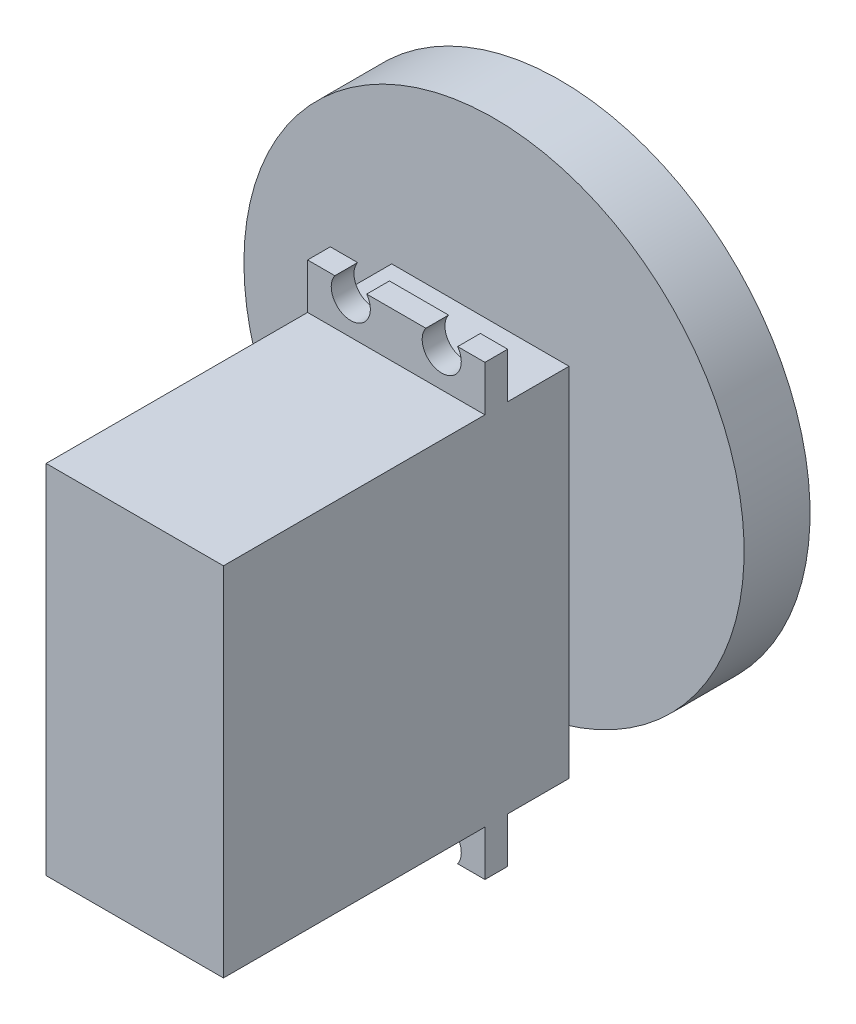
ISO-10303-21;
HEADER;
FILE_DESCRIPTION(('STEP AP214'),'2;1');
FILE_NAME('part.step','',(''),(''),'','','');
FILE_SCHEMA(('AUTOMOTIVE_DESIGN { 1 0 10303 214 1 1 1 1 }'));
ENDSEC;
DATA;
#1=APPLICATION_CONTEXT('core data for automotive mechanical design processes');
#2=APPLICATION_PROTOCOL_DEFINITION('international standard','automotive_design',2000,#1);
#3=PRODUCT_CONTEXT('',#1,'mechanical');
#4=PRODUCT('Part','Part','',(#3));
#5=PRODUCT_RELATED_PRODUCT_CATEGORY('part','',(#4));
#6=PRODUCT_DEFINITION_FORMATION('','',#4);
#7=PRODUCT_DEFINITION_CONTEXT('part definition',#1,'design');
#8=PRODUCT_DEFINITION('design','',#6,#7);
#9=PRODUCT_DEFINITION_SHAPE('','',#8);
#10=(LENGTH_UNIT() NAMED_UNIT(*) SI_UNIT(.MILLI.,.METRE.));
#11=(NAMED_UNIT(*) PLANE_ANGLE_UNIT() SI_UNIT($,.RADIAN.));
#12=(NAMED_UNIT(*) SI_UNIT($,.STERADIAN.) SOLID_ANGLE_UNIT());
#13=UNCERTAINTY_MEASURE_WITH_UNIT(LENGTH_MEASURE(1.E-05),#10,'distance_accuracy_value','');
#14=(GEOMETRIC_REPRESENTATION_CONTEXT(3) GLOBAL_UNCERTAINTY_ASSIGNED_CONTEXT((#13)) GLOBAL_UNIT_ASSIGNED_CONTEXT((#10,
#11,#12)) REPRESENTATION_CONTEXT('',''));
#15=CARTESIAN_POINT('',(0.,0.,0.));
#16=DIRECTION('',(0.,0.,1.));
#17=DIRECTION('',(1.,0.,0.));
#18=AXIS2_PLACEMENT_3D('',#15,#16,#17);
#19=CARTESIAN_POINT('',(4.826,43.688,-2.54));
#20=DIRECTION('',(0.,0.,-1.));
#21=DIRECTION('',(-1.,0.,0.));
#22=AXIS2_PLACEMENT_3D('',#19,#20,#21);
#23=PLANE('',#22);
#24=DIRECTION('',(1.,0.,0.));
#25=VECTOR('',#24,1.);
#26=CARTESIAN_POINT('',(0.,39.878,-2.54));
#27=LINE('',#26,#25);
#28=CARTESIAN_POINT('',(0.,39.878,-2.54));
#29=VERTEX_POINT('',#28);
#30=CARTESIAN_POINT('',(19.812,39.878,-2.54));
#31=VERTEX_POINT('',#30);
#32=EDGE_CURVE('E194',#29,#31,#27,.T.);
#33=ORIENTED_EDGE('',*,*,#32,.F.);
#34=DIRECTION('',(0.,1.,0.));
#35=VECTOR('',#34,1.);
#36=CARTESIAN_POINT('',(0.,-5.08,-2.54));
#37=LINE('',#36,#35);
#38=CARTESIAN_POINT('',(0.,44.958,-2.54));
#39=VERTEX_POINT('',#38);
#40=EDGE_CURVE('E400',#29,#39,#37,.T.);
#41=ORIENTED_EDGE('',*,*,#40,.T.);
#42=DIRECTION('',(1.,0.,0.));
#43=VECTOR('',#42,1.);
#44=CARTESIAN_POINT('',(0.,44.958,-2.54));
#45=LINE('',#44,#43);
#46=CARTESIAN_POINT('',(3.04872586245116,44.958,-2.54));
#47=VERTEX_POINT('',#46);
#48=EDGE_CURVE('E488',#39,#47,#45,.T.);
#49=ORIENTED_EDGE('',*,*,#48,.T.);
#50=CARTESIAN_POINT('',(4.826,43.688,-2.54));
#51=DIRECTION('',(0.,0.,1.));
#52=DIRECTION('',(-1.,0.,0.));
#53=AXIS2_PLACEMENT_3D('',#50,#51,#52);
#54=CIRCLE('',#53,2.1844);
#55=CARTESIAN_POINT('',(6.60327413754884,44.958,-2.54));
#56=VERTEX_POINT('',#55);
#57=EDGE_CURVE('E502',#47,#56,#54,.T.);
#58=ORIENTED_EDGE('',*,*,#57,.T.);
#59=DIRECTION('',(1.,0.,0.));
#60=VECTOR('',#59,1.);
#61=CARTESIAN_POINT('',(6.60327413754884,44.958,-2.54));
#62=LINE('',#61,#60);
#63=CARTESIAN_POINT('',(13.2087258624512,44.958,-2.54));
#64=VERTEX_POINT('',#63);
#65=EDGE_CURVE('E500',#56,#64,#62,.T.);
#66=ORIENTED_EDGE('',*,*,#65,.T.);
#67=CARTESIAN_POINT('',(14.986,43.688,-2.54));
#68=DIRECTION('',(0.,0.,1.));
#69=DIRECTION('',(-1.,0.,0.));
#70=AXIS2_PLACEMENT_3D('',#67,#68,#69);
#71=CIRCLE('',#70,2.1844);
#72=CARTESIAN_POINT('',(16.7632741375488,44.958,-2.54));
#73=VERTEX_POINT('',#72);
#74=EDGE_CURVE('E498',#64,#73,#71,.T.);
#75=ORIENTED_EDGE('',*,*,#74,.T.);
#76=DIRECTION('',(1.,0.,0.));
#77=VECTOR('',#76,1.);
#78=CARTESIAN_POINT('',(16.7632741375488,44.958,-2.54));
#79=LINE('',#78,#77);
#80=CARTESIAN_POINT('',(19.812,44.958,-2.54));
#81=VERTEX_POINT('',#80);
#82=EDGE_CURVE('E481',#73,#81,#79,.T.);
#83=ORIENTED_EDGE('',*,*,#82,.T.);
#84=DIRECTION('',(0.,-1.,0.));
#85=VECTOR('',#84,1.);
#86=CARTESIAN_POINT('',(19.812,-5.08,-2.54));
#87=LINE('',#86,#85);
#88=EDGE_CURVE('E58',#81,#31,#87,.T.);
#89=ORIENTED_EDGE('',*,*,#88,.T.);
#90=EDGE_LOOP('',(#33,#41,#49,#58,#66,#75,#83,#89));
#91=FACE_BOUND('',#90,.T.);
#92=ADVANCED_FACE('F35',(#91),#23,.T.);
#93=CARTESIAN_POINT('',(0.,0.,29.21));
#94=DIRECTION('',(1.,0.,0.));
#95=DIRECTION('',(0.,1.,0.));
#96=AXIS2_PLACEMENT_3D('',#93,#94,#95);
#97=PLANE('',#96);
#98=DIRECTION('',(0.,0.,-1.));
#99=VECTOR('',#98,1.);
#100=CARTESIAN_POINT('',(0.,39.878,29.21));
#101=LINE('',#100,#99);
#102=CARTESIAN_POINT('',(0.,39.878,29.21));
#103=VERTEX_POINT('',#102);
#104=CARTESIAN_POINT('',(0.,39.878,0.));
#105=VERTEX_POINT('',#104);
#106=EDGE_CURVE('E358',#103,#105,#101,.T.);
#107=ORIENTED_EDGE('',*,*,#106,.T.);
#108=DIRECTION('',(0.,1.,0.));
#109=VECTOR('',#108,1.);
#110=CARTESIAN_POINT('',(0.,-5.08,0.));
#111=LINE('',#110,#109);
#112=CARTESIAN_POINT('',(0.,44.958,0.));
#113=VERTEX_POINT('',#112);
#114=EDGE_CURVE('E195',#105,#113,#111,.T.);
#115=ORIENTED_EDGE('',*,*,#114,.T.);
#116=DIRECTION('',(0.,0.,1.));
#117=VECTOR('',#116,1.);
#118=CARTESIAN_POINT('',(0.,44.958,-2.54));
#119=LINE('',#118,#117);
#120=EDGE_CURVE('E347',#39,#113,#119,.T.);
#121=ORIENTED_EDGE('',*,*,#120,.F.);
#122=ORIENTED_EDGE('',*,*,#40,.F.);
#123=DIRECTION('',(0.,0.,1.));
#124=VECTOR('',#123,1.);
#125=CARTESIAN_POINT('',(0.,39.878,-9.398));
#126=LINE('',#125,#124);
#127=CARTESIAN_POINT('',(0.,39.878,-9.398));
#128=VERTEX_POINT('',#127);
#129=EDGE_CURVE('E209',#128,#29,#126,.T.);
#130=ORIENTED_EDGE('',*,*,#129,.F.);
#131=DIRECTION('',(0.,1.,0.));
#132=VECTOR('',#131,1.);
#133=CARTESIAN_POINT('',(0.,0.,-9.398));
#134=LINE('',#133,#132);
#135=CARTESIAN_POINT('',(0.,0.,-9.398));
#136=VERTEX_POINT('',#135);
#137=EDGE_CURVE('E188',#136,#128,#134,.T.);
#138=ORIENTED_EDGE('',*,*,#137,.F.);
#139=DIRECTION('',(0.,0.,1.));
#140=VECTOR('',#139,1.);
#141=CARTESIAN_POINT('',(0.,0.,-9.398));
#142=LINE('',#141,#140);
#143=CARTESIAN_POINT('',(0.,0.,-2.54));
#144=VERTEX_POINT('',#143);
#145=EDGE_CURVE('E199',#136,#144,#142,.T.);
#146=ORIENTED_EDGE('',*,*,#145,.T.);
#147=CARTESIAN_POINT('',(0.,-5.08,-2.54));
#148=VERTEX_POINT('',#147);
#149=EDGE_CURVE('E486',#148,#144,#37,.T.);
#150=ORIENTED_EDGE('',*,*,#149,.F.);
#151=DIRECTION('',(0.,0.,1.));
#152=VECTOR('',#151,1.);
#153=CARTESIAN_POINT('',(0.,-5.08,-2.54));
#154=LINE('',#153,#152);
#155=CARTESIAN_POINT('',(0.,-5.08,0.));
#156=VERTEX_POINT('',#155);
#157=EDGE_CURVE('E401',#148,#156,#154,.T.);
#158=ORIENTED_EDGE('',*,*,#157,.T.);
#159=CARTESIAN_POINT('',(0.,0.,0.));
#160=VERTEX_POINT('',#159);
#161=EDGE_CURVE('E197',#156,#160,#111,.T.);
#162=ORIENTED_EDGE('',*,*,#161,.T.);
#163=DIRECTION('',(0.,0.,-1.));
#164=VECTOR('',#163,1.);
#165=CARTESIAN_POINT('',(0.,0.,29.21));
#166=LINE('',#165,#164);
#167=CARTESIAN_POINT('',(0.,0.,29.21));
#168=VERTEX_POINT('',#167);
#169=EDGE_CURVE('E43',#168,#160,#166,.T.);
#170=ORIENTED_EDGE('',*,*,#169,.F.);
#171=DIRECTION('',(0.,-1.,0.));
#172=VECTOR('',#171,1.);
#173=CARTESIAN_POINT('',(0.,0.,29.21));
#174=LINE('',#173,#172);
#175=EDGE_CURVE('E369',#103,#168,#174,.T.);
#176=ORIENTED_EDGE('',*,*,#175,.F.);
#177=EDGE_LOOP('',(#107,#115,#121,#122,#130,#138,#146,#150,#158,#162,#170,#176));
#178=FACE_BOUND('',#177,.T.);
#179=ADVANCED_FACE('F37',(#178),#97,.F.);
#180=CARTESIAN_POINT('',(0.,0.,29.21));
#181=DIRECTION('',(0.,1.,0.));
#182=DIRECTION('',(0.,0.,1.));
#183=AXIS2_PLACEMENT_3D('',#180,#181,#182);
#184=PLANE('',#183);
#185=DIRECTION('',(1.,0.,0.));
#186=VECTOR('',#185,1.);
#187=CARTESIAN_POINT('',(0.,0.,0.));
#188=LINE('',#187,#186);
#189=CARTESIAN_POINT('',(19.812,0.,0.));
#190=VERTEX_POINT('',#189);
#191=EDGE_CURVE('E340',#160,#190,#188,.T.);
#192=ORIENTED_EDGE('',*,*,#191,.T.);
#193=DIRECTION('',(0.,0.,-1.));
#194=VECTOR('',#193,1.);
#195=CARTESIAN_POINT('',(19.812,0.,29.21));
#196=LINE('',#195,#194);
#197=CARTESIAN_POINT('',(19.812,0.,29.21));
#198=VERTEX_POINT('',#197);
#199=EDGE_CURVE('E341',#198,#190,#196,.T.);
#200=ORIENTED_EDGE('',*,*,#199,.F.);
#201=DIRECTION('',(1.,0.,0.));
#202=VECTOR('',#201,1.);
#203=CARTESIAN_POINT('',(0.,0.,29.21));
#204=LINE('',#203,#202);
#205=EDGE_CURVE('E377',#168,#198,#204,.T.);
#206=ORIENTED_EDGE('',*,*,#205,.F.);
#207=ORIENTED_EDGE('',*,*,#169,.T.);
#208=EDGE_LOOP('',(#192,#200,#206,#207));
#209=FACE_BOUND('',#208,.T.);
#210=ADVANCED_FACE('F271',(#209),#184,.F.);
#211=CARTESIAN_POINT('',(19.812,0.,29.21));
#212=DIRECTION('',(-1.,0.,0.));
#213=DIRECTION('',(0.,-1.,0.));
#214=AXIS2_PLACEMENT_3D('',#211,#212,#213);
#215=PLANE('',#214);
#216=ORIENTED_EDGE('',*,*,#199,.T.);
#217=DIRECTION('',(0.,-1.,0.));
#218=VECTOR('',#217,1.);
#219=CARTESIAN_POINT('',(19.812,-5.08,0.));
#220=LINE('',#219,#218);
#221=CARTESIAN_POINT('',(19.812,-5.08,0.));
#222=VERTEX_POINT('',#221);
#223=EDGE_CURVE('E350',#190,#222,#220,.T.);
#224=ORIENTED_EDGE('',*,*,#223,.T.);
#225=DIRECTION('',(0.,0.,1.));
#226=VECTOR('',#225,1.);
#227=CARTESIAN_POINT('',(19.812,-5.08,-2.54));
#228=LINE('',#227,#226);
#229=CARTESIAN_POINT('',(19.812,-5.08,-2.54));
#230=VERTEX_POINT('',#229);
#231=EDGE_CURVE('E417',#230,#222,#228,.T.);
#232=ORIENTED_EDGE('',*,*,#231,.F.);
#233=CARTESIAN_POINT('',(19.812,0.,-2.54));
#234=VERTEX_POINT('',#233);
#235=EDGE_CURVE('E221',#234,#230,#87,.T.);
#236=ORIENTED_EDGE('',*,*,#235,.F.);
#237=DIRECTION('',(0.,0.,1.));
#238=VECTOR('',#237,1.);
#239=CARTESIAN_POINT('',(19.812,0.,-9.398));
#240=LINE('',#239,#238);
#241=CARTESIAN_POINT('',(19.812,0.,-9.398));
#242=VERTEX_POINT('',#241);
#243=EDGE_CURVE('E179',#242,#234,#240,.T.);
#244=ORIENTED_EDGE('',*,*,#243,.F.);
#245=DIRECTION('',(0.,-1.,0.));
#246=VECTOR('',#245,1.);
#247=CARTESIAN_POINT('',(19.812,39.878,-9.398));
#248=LINE('',#247,#246);
#249=CARTESIAN_POINT('',(19.812,39.878,-9.398));
#250=VERTEX_POINT('',#249);
#251=EDGE_CURVE('E171',#250,#242,#248,.T.);
#252=ORIENTED_EDGE('',*,*,#251,.F.);
#253=DIRECTION('',(0.,0.,1.));
#254=VECTOR('',#253,1.);
#255=CARTESIAN_POINT('',(19.812,39.878,-9.398));
#256=LINE('',#255,#254);
#257=EDGE_CURVE('E176',#250,#31,#256,.T.);
#258=ORIENTED_EDGE('',*,*,#257,.T.);
#259=ORIENTED_EDGE('',*,*,#88,.F.);
#260=DIRECTION('',(0.,0.,1.));
#261=VECTOR('',#260,1.);
#262=CARTESIAN_POINT('',(19.812,44.958,-2.54));
#263=LINE('',#262,#261);
#264=CARTESIAN_POINT('',(19.812,44.958,0.));
#265=VERTEX_POINT('',#264);
#266=EDGE_CURVE('E419',#81,#265,#263,.T.);
#267=ORIENTED_EDGE('',*,*,#266,.T.);
#268=CARTESIAN_POINT('',(19.812,39.878,0.));
#269=VERTEX_POINT('',#268);
#270=EDGE_CURVE('E383',#265,#269,#220,.T.);
#271=ORIENTED_EDGE('',*,*,#270,.T.);
#272=DIRECTION('',(0.,0.,-1.));
#273=VECTOR('',#272,1.);
#274=CARTESIAN_POINT('',(19.812,39.878,29.21));
#275=LINE('',#274,#273);
#276=CARTESIAN_POINT('',(19.812,39.878,29.21));
#277=VERTEX_POINT('',#276);
#278=EDGE_CURVE('E354',#277,#269,#275,.T.);
#279=ORIENTED_EDGE('',*,*,#278,.F.);
#280=DIRECTION('',(0.,1.,0.));
#281=VECTOR('',#280,1.);
#282=CARTESIAN_POINT('',(19.812,0.,29.21));
#283=LINE('',#282,#281);
#284=EDGE_CURVE('E353',#198,#277,#283,.T.);
#285=ORIENTED_EDGE('',*,*,#284,.F.);
#286=EDGE_LOOP('',(#216,#224,#232,#236,#244,#252,#258,#259,#267,#271,#279,#285));
#287=FACE_BOUND('',#286,.T.);
#288=ADVANCED_FACE('F174',(#287),#215,.F.);
#289=CARTESIAN_POINT('',(0.,39.878,29.21));
#290=DIRECTION('',(0.,-1.,0.));
#291=DIRECTION('',(0.,0.,-1.));
#292=AXIS2_PLACEMENT_3D('',#289,#290,#291);
#293=PLANE('',#292);
#294=DIRECTION('',(-1.,0.,0.));
#295=VECTOR('',#294,1.);
#296=CARTESIAN_POINT('',(0.,39.878,0.));
#297=LINE('',#296,#295);
#298=EDGE_CURVE('E346',#269,#105,#297,.T.);
#299=ORIENTED_EDGE('',*,*,#298,.T.);
#300=ORIENTED_EDGE('',*,*,#106,.F.);
#301=DIRECTION('',(-1.,0.,0.));
#302=VECTOR('',#301,1.);
#303=CARTESIAN_POINT('',(0.,39.878,29.21));
#304=LINE('',#303,#302);
#305=EDGE_CURVE('E374',#277,#103,#304,.T.);
#306=ORIENTED_EDGE('',*,*,#305,.F.);
#307=ORIENTED_EDGE('',*,*,#278,.T.);
#308=EDGE_LOOP('',(#299,#300,#306,#307));
#309=FACE_BOUND('',#308,.T.);
#310=ADVANCED_FACE('F327',(#309),#293,.F.);
#311=CARTESIAN_POINT('',(0.,0.,29.21));
#312=DIRECTION('',(0.,0.,-1.));
#313=DIRECTION('',(-1.,0.,0.));
#314=AXIS2_PLACEMENT_3D('',#311,#312,#313);
#315=PLANE('',#314);
#316=ORIENTED_EDGE('',*,*,#175,.T.);
#317=ORIENTED_EDGE('',*,*,#205,.T.);
#318=ORIENTED_EDGE('',*,*,#284,.T.);
#319=ORIENTED_EDGE('',*,*,#305,.T.);
#320=EDGE_LOOP('',(#316,#317,#318,#319));
#321=FACE_BOUND('',#320,.T.);
#322=ADVANCED_FACE('F324',(#321),#315,.F.);
#323=CARTESIAN_POINT('',(4.826,43.688,0.));
#324=DIRECTION('',(0.,0.,-1.));
#325=DIRECTION('',(-1.,0.,0.));
#326=AXIS2_PLACEMENT_3D('',#323,#324,#325);
#327=PLANE('',#326);
#328=ORIENTED_EDGE('',*,*,#298,.F.);
#329=ORIENTED_EDGE('',*,*,#270,.F.);
#330=DIRECTION('',(1.,0.,0.));
#331=VECTOR('',#330,1.);
#332=CARTESIAN_POINT('',(16.7632741375488,44.958,0.));
#333=LINE('',#332,#331);
#334=CARTESIAN_POINT('',(16.7632741375488,44.958,0.));
#335=VERTEX_POINT('',#334);
#336=EDGE_CURVE('E384',#335,#265,#333,.T.);
#337=ORIENTED_EDGE('',*,*,#336,.F.);
#338=CARTESIAN_POINT('',(14.986,43.688,0.));
#339=DIRECTION('',(0.,0.,1.));
#340=DIRECTION('',(-1.,0.,0.));
#341=AXIS2_PLACEMENT_3D('',#338,#339,#340);
#342=CIRCLE('',#341,2.1844);
#343=CARTESIAN_POINT('',(13.2087258624512,44.958,0.));
#344=VERTEX_POINT('',#343);
#345=EDGE_CURVE('E447',#344,#335,#342,.T.);
#346=ORIENTED_EDGE('',*,*,#345,.F.);
#347=DIRECTION('',(1.,0.,0.));
#348=VECTOR('',#347,1.);
#349=CARTESIAN_POINT('',(6.60327413754884,44.958,0.));
#350=LINE('',#349,#348);
#351=CARTESIAN_POINT('',(6.60327413754884,44.958,0.));
#352=VERTEX_POINT('',#351);
#353=EDGE_CURVE('E446',#352,#344,#350,.T.);
#354=ORIENTED_EDGE('',*,*,#353,.F.);
#355=CARTESIAN_POINT('',(4.826,43.688,0.));
#356=DIRECTION('',(0.,0.,1.));
#357=DIRECTION('',(-1.,0.,0.));
#358=AXIS2_PLACEMENT_3D('',#355,#356,#357);
#359=CIRCLE('',#358,2.1844);
#360=CARTESIAN_POINT('',(3.04872586245116,44.958,0.));
#361=VERTEX_POINT('',#360);
#362=EDGE_CURVE('E444',#361,#352,#359,.T.);
#363=ORIENTED_EDGE('',*,*,#362,.F.);
#364=DIRECTION('',(1.,0.,0.));
#365=VECTOR('',#364,1.);
#366=CARTESIAN_POINT('',(0.,44.958,0.));
#367=LINE('',#366,#365);
#368=EDGE_CURVE('E437',#113,#361,#367,.T.);
#369=ORIENTED_EDGE('',*,*,#368,.F.);
#370=ORIENTED_EDGE('',*,*,#114,.F.);
#371=EDGE_LOOP('',(#328,#329,#337,#346,#354,#363,#369,#370));
#372=FACE_BOUND('',#371,.T.);
#373=ADVANCED_FACE('F282',(#372),#327,.F.);
#374=CARTESIAN_POINT('',(0.,44.958,-2.54));
#375=DIRECTION('',(0.,-1.,0.));
#376=DIRECTION('',(0.,0.,-1.));
#377=AXIS2_PLACEMENT_3D('',#374,#375,#376);
#378=PLANE('',#377);
#379=ORIENTED_EDGE('',*,*,#368,.T.);
#380=DIRECTION('',(0.,0.,1.));
#381=VECTOR('',#380,1.);
#382=CARTESIAN_POINT('',(3.04872586245116,44.958,-2.54));
#383=LINE('',#382,#381);
#384=EDGE_CURVE('E431',#47,#361,#383,.T.);
#385=ORIENTED_EDGE('',*,*,#384,.F.);
#386=ORIENTED_EDGE('',*,*,#48,.F.);
#387=ORIENTED_EDGE('',*,*,#120,.T.);
#388=EDGE_LOOP('',(#379,#385,#386,#387));
#389=FACE_BOUND('',#388,.T.);
#390=ADVANCED_FACE('F319',(#389),#378,.F.);
#391=CARTESIAN_POINT('',(4.826,43.688,-2.54));
#392=DIRECTION('',(0.,0.,1.));
#393=DIRECTION('',(1.,0.,0.));
#394=AXIS2_PLACEMENT_3D('',#391,#392,#393);
#395=CYLINDRICAL_SURFACE('',#394,2.1844);
#396=ORIENTED_EDGE('',*,*,#362,.T.);
#397=DIRECTION('',(0.,0.,1.));
#398=VECTOR('',#397,1.);
#399=CARTESIAN_POINT('',(6.60327413754884,44.958,-2.54));
#400=LINE('',#399,#398);
#401=EDGE_CURVE('E428',#56,#352,#400,.T.);
#402=ORIENTED_EDGE('',*,*,#401,.F.);
#403=ORIENTED_EDGE('',*,*,#57,.F.);
#404=ORIENTED_EDGE('',*,*,#384,.T.);
#405=EDGE_LOOP('',(#396,#402,#403,#404));
#406=FACE_BOUND('',#405,.T.);
#407=ADVANCED_FACE('F315',(#406),#395,.F.);
#408=CARTESIAN_POINT('',(6.60327413754884,44.958,-2.54));
#409=DIRECTION('',(0.,-1.,0.));
#410=DIRECTION('',(0.,0.,-1.));
#411=AXIS2_PLACEMENT_3D('',#408,#409,#410);
#412=PLANE('',#411);
#413=ORIENTED_EDGE('',*,*,#353,.T.);
#414=DIRECTION('',(0.,0.,1.));
#415=VECTOR('',#414,1.);
#416=CARTESIAN_POINT('',(13.2087258624512,44.958,-2.54));
#417=LINE('',#416,#415);
#418=EDGE_CURVE('E425',#64,#344,#417,.T.);
#419=ORIENTED_EDGE('',*,*,#418,.F.);
#420=ORIENTED_EDGE('',*,*,#65,.F.);
#421=ORIENTED_EDGE('',*,*,#401,.T.);
#422=EDGE_LOOP('',(#413,#419,#420,#421));
#423=FACE_BOUND('',#422,.T.);
#424=ADVANCED_FACE('F311',(#423),#412,.F.);
#425=CARTESIAN_POINT('',(14.986,43.688,-2.54));
#426=DIRECTION('',(0.,0.,1.));
#427=DIRECTION('',(1.,0.,0.));
#428=AXIS2_PLACEMENT_3D('',#425,#426,#427);
#429=CYLINDRICAL_SURFACE('',#428,2.1844);
#430=ORIENTED_EDGE('',*,*,#345,.T.);
#431=DIRECTION('',(0.,0.,1.));
#432=VECTOR('',#431,1.);
#433=CARTESIAN_POINT('',(16.7632741375488,44.958,-2.54));
#434=LINE('',#433,#432);
#435=EDGE_CURVE('E422',#73,#335,#434,.T.);
#436=ORIENTED_EDGE('',*,*,#435,.F.);
#437=ORIENTED_EDGE('',*,*,#74,.F.);
#438=ORIENTED_EDGE('',*,*,#418,.T.);
#439=EDGE_LOOP('',(#430,#436,#437,#438));
#440=FACE_BOUND('',#439,.T.);
#441=ADVANCED_FACE('F307',(#440),#429,.F.);
#442=CARTESIAN_POINT('',(16.7632741375488,44.958,-2.54));
#443=DIRECTION('',(0.,-1.,0.));
#444=DIRECTION('',(0.,0.,-1.));
#445=AXIS2_PLACEMENT_3D('',#442,#443,#444);
#446=PLANE('',#445);
#447=ORIENTED_EDGE('',*,*,#336,.T.);
#448=ORIENTED_EDGE('',*,*,#266,.F.);
#449=ORIENTED_EDGE('',*,*,#82,.F.);
#450=ORIENTED_EDGE('',*,*,#435,.T.);
#451=EDGE_LOOP('',(#447,#448,#449,#450));
#452=FACE_BOUND('',#451,.T.);
#453=ADVANCED_FACE('F303',(#452),#446,.F.);
#454=CARTESIAN_POINT('',(16.7632741375488,-5.08,-2.54));
#455=DIRECTION('',(0.,1.,0.));
#456=DIRECTION('',(-1.,0.,0.));
#457=AXIS2_PLACEMENT_3D('',#454,#455,#456);
#458=PLANE('',#457);
#459=DIRECTION('',(-1.,0.,0.));
#460=VECTOR('',#459,1.);
#461=CARTESIAN_POINT('',(16.7632741375488,-5.08,0.));
#462=LINE('',#461,#460);
#463=CARTESIAN_POINT('',(16.7632741375488,-5.08,0.));
#464=VERTEX_POINT('',#463);
#465=EDGE_CURVE('E389',#222,#464,#462,.T.);
#466=ORIENTED_EDGE('',*,*,#465,.T.);
#467=DIRECTION('',(0.,0.,1.));
#468=VECTOR('',#467,1.);
#469=CARTESIAN_POINT('',(16.7632741375488,-5.08,-2.54));
#470=LINE('',#469,#468);
#471=CARTESIAN_POINT('',(16.7632741375488,-5.08,-2.54));
#472=VERTEX_POINT('',#471);
#473=EDGE_CURVE('E414',#472,#464,#470,.T.);
#474=ORIENTED_EDGE('',*,*,#473,.F.);
#475=DIRECTION('',(-1.,0.,0.));
#476=VECTOR('',#475,1.);
#477=CARTESIAN_POINT('',(16.7632741375488,-5.08,-2.54));
#478=LINE('',#477,#476);
#479=EDGE_CURVE('E480',#230,#472,#478,.T.);
#480=ORIENTED_EDGE('',*,*,#479,.F.);
#481=ORIENTED_EDGE('',*,*,#231,.T.);
#482=EDGE_LOOP('',(#466,#474,#480,#481));
#483=FACE_BOUND('',#482,.T.);
#484=ADVANCED_FACE('F299',(#483),#458,.F.);
#485=CARTESIAN_POINT('',(14.986,-3.81,-2.54));
#486=DIRECTION('',(0.,0.,1.));
#487=DIRECTION('',(1.,0.,0.));
#488=AXIS2_PLACEMENT_3D('',#485,#486,#487);
#489=CYLINDRICAL_SURFACE('',#488,2.1844);
#490=CARTESIAN_POINT('',(14.986,-3.81,0.));
#491=DIRECTION('',(0.,0.,1.));
#492=DIRECTION('',(-1.,0.,0.));
#493=AXIS2_PLACEMENT_3D('',#490,#491,#492);
#494=CIRCLE('',#493,2.1844);
#495=CARTESIAN_POINT('',(13.2087258624512,-5.08,0.));
#496=VERTEX_POINT('',#495);
#497=EDGE_CURVE('E392',#464,#496,#494,.T.);
#498=ORIENTED_EDGE('',*,*,#497,.T.);
#499=DIRECTION('',(0.,0.,1.));
#500=VECTOR('',#499,1.);
#501=CARTESIAN_POINT('',(13.2087258624512,-5.08,-2.54));
#502=LINE('',#501,#500);
#503=CARTESIAN_POINT('',(13.2087258624512,-5.08,-2.54));
#504=VERTEX_POINT('',#503);
#505=EDGE_CURVE('E411',#504,#496,#502,.T.);
#506=ORIENTED_EDGE('',*,*,#505,.F.);
#507=CARTESIAN_POINT('',(14.986,-3.81,-2.54));
#508=DIRECTION('',(0.,0.,1.));
#509=DIRECTION('',(-1.,0.,0.));
#510=AXIS2_PLACEMENT_3D('',#507,#508,#509);
#511=CIRCLE('',#510,2.1844);
#512=EDGE_CURVE('E478',#472,#504,#511,.T.);
#513=ORIENTED_EDGE('',*,*,#512,.F.);
#514=ORIENTED_EDGE('',*,*,#473,.T.);
#515=EDGE_LOOP('',(#498,#506,#513,#514));
#516=FACE_BOUND('',#515,.T.);
#517=ADVANCED_FACE('F295',(#516),#489,.F.);
#518=CARTESIAN_POINT('',(6.60327413754883,-5.08,-2.54));
#519=DIRECTION('',(0.,1.,0.));
#520=DIRECTION('',(-1.,0.,0.));
#521=AXIS2_PLACEMENT_3D('',#518,#519,#520);
#522=PLANE('',#521);
#523=DIRECTION('',(-1.,0.,0.));
#524=VECTOR('',#523,1.);
#525=CARTESIAN_POINT('',(6.60327413754883,-5.08,0.));
#526=LINE('',#525,#524);
#527=CARTESIAN_POINT('',(6.60327413754883,-5.08,0.));
#528=VERTEX_POINT('',#527);
#529=EDGE_CURVE('E394',#496,#528,#526,.T.);
#530=ORIENTED_EDGE('',*,*,#529,.T.);
#531=DIRECTION('',(0.,0.,1.));
#532=VECTOR('',#531,1.);
#533=CARTESIAN_POINT('',(6.60327413754883,-5.08,-2.54));
#534=LINE('',#533,#532);
#535=CARTESIAN_POINT('',(6.60327413754883,-5.08,-2.54));
#536=VERTEX_POINT('',#535);
#537=EDGE_CURVE('E408',#536,#528,#534,.T.);
#538=ORIENTED_EDGE('',*,*,#537,.F.);
#539=DIRECTION('',(-1.,0.,0.));
#540=VECTOR('',#539,1.);
#541=CARTESIAN_POINT('',(6.60327413754883,-5.08,-2.54));
#542=LINE('',#541,#540);
#543=EDGE_CURVE('E472',#504,#536,#542,.T.);
#544=ORIENTED_EDGE('',*,*,#543,.F.);
#545=ORIENTED_EDGE('',*,*,#505,.T.);
#546=EDGE_LOOP('',(#530,#538,#544,#545));
#547=FACE_BOUND('',#546,.T.);
#548=ADVANCED_FACE('F289',(#547),#522,.F.);
#549=CARTESIAN_POINT('',(4.82599999999999,-3.81,-2.54));
#550=DIRECTION('',(0.,0.,1.));
#551=DIRECTION('',(1.,0.,0.));
#552=AXIS2_PLACEMENT_3D('',#549,#550,#551);
#553=CYLINDRICAL_SURFACE('',#552,2.1844);
#554=CARTESIAN_POINT('',(4.82599999999999,-3.81,0.));
#555=DIRECTION('',(0.,0.,1.));
#556=DIRECTION('',(-1.,0.,0.));
#557=AXIS2_PLACEMENT_3D('',#554,#555,#556);
#558=CIRCLE('',#557,2.1844);
#559=CARTESIAN_POINT('',(3.04872586245114,-5.08,0.));
#560=VERTEX_POINT('',#559);
#561=EDGE_CURVE('E396',#528,#560,#558,.T.);
#562=ORIENTED_EDGE('',*,*,#561,.T.);
#563=DIRECTION('',(0.,0.,1.));
#564=VECTOR('',#563,1.);
#565=CARTESIAN_POINT('',(3.04872586245114,-5.08,-2.54));
#566=LINE('',#565,#564);
#567=CARTESIAN_POINT('',(3.04872586245114,-5.08,-2.54));
#568=VERTEX_POINT('',#567);
#569=EDGE_CURVE('E404',#568,#560,#566,.T.);
#570=ORIENTED_EDGE('',*,*,#569,.F.);
#571=CARTESIAN_POINT('',(4.82599999999999,-3.81,-2.54));
#572=DIRECTION('',(0.,0.,1.));
#573=DIRECTION('',(-1.,0.,0.));
#574=AXIS2_PLACEMENT_3D('',#571,#572,#573);
#575=CIRCLE('',#574,2.1844);
#576=EDGE_CURVE('E469',#536,#568,#575,.T.);
#577=ORIENTED_EDGE('',*,*,#576,.F.);
#578=ORIENTED_EDGE('',*,*,#537,.T.);
#579=EDGE_LOOP('',(#562,#570,#577,#578));
#580=FACE_BOUND('',#579,.T.);
#581=ADVANCED_FACE('F283',(#580),#553,.F.);
#582=CARTESIAN_POINT('',(0.,-5.08,-2.54));
#583=DIRECTION('',(0.,1.,0.));
#584=DIRECTION('',(0.,0.,1.));
#585=AXIS2_PLACEMENT_3D('',#582,#583,#584);
#586=PLANE('',#585);
#587=DIRECTION('',(-1.,0.,0.));
#588=VECTOR('',#587,1.);
#589=CARTESIAN_POINT('',(0.,-5.08,0.));
#590=LINE('',#589,#588);
#591=EDGE_CURVE('E398',#560,#156,#590,.T.);
#592=ORIENTED_EDGE('',*,*,#591,.T.);
#593=ORIENTED_EDGE('',*,*,#157,.F.);
#594=DIRECTION('',(-1.,0.,0.));
#595=VECTOR('',#594,1.);
#596=CARTESIAN_POINT('',(0.,-5.08,-2.54));
#597=LINE('',#596,#595);
#598=EDGE_CURVE('E405',#568,#148,#597,.T.);
#599=ORIENTED_EDGE('',*,*,#598,.F.);
#600=ORIENTED_EDGE('',*,*,#569,.T.);
#601=EDGE_LOOP('',(#592,#593,#599,#600));
#602=FACE_BOUND('',#601,.T.);
#603=ADVANCED_FACE('F276',(#602),#586,.F.);
#604=DIRECTION('',(-1.,0.,0.));
#605=VECTOR('',#604,1.);
#606=CARTESIAN_POINT('',(19.812,0.,-2.54));
#607=LINE('',#606,#605);
#608=EDGE_CURVE('E50',#234,#144,#607,.T.);
#609=ORIENTED_EDGE('',*,*,#608,.F.);
#610=ORIENTED_EDGE('',*,*,#235,.T.);
#611=ORIENTED_EDGE('',*,*,#479,.T.);
#612=ORIENTED_EDGE('',*,*,#512,.T.);
#613=ORIENTED_EDGE('',*,*,#543,.T.);
#614=ORIENTED_EDGE('',*,*,#576,.T.);
#615=ORIENTED_EDGE('',*,*,#598,.T.);
#616=ORIENTED_EDGE('',*,*,#149,.T.);
#617=EDGE_LOOP('',(#609,#610,#611,#612,#613,#614,#615,#616));
#618=FACE_BOUND('',#617,.T.);
#619=ADVANCED_FACE('F267',(#618),#23,.T.);
#620=ORIENTED_EDGE('',*,*,#191,.F.);
#621=ORIENTED_EDGE('',*,*,#161,.F.);
#622=ORIENTED_EDGE('',*,*,#591,.F.);
#623=ORIENTED_EDGE('',*,*,#561,.F.);
#624=ORIENTED_EDGE('',*,*,#529,.F.);
#625=ORIENTED_EDGE('',*,*,#497,.F.);
#626=ORIENTED_EDGE('',*,*,#465,.F.);
#627=ORIENTED_EDGE('',*,*,#223,.F.);
#628=EDGE_LOOP('',(#620,#621,#622,#623,#624,#625,#626,#627));
#629=FACE_BOUND('',#628,.T.);
#630=ADVANCED_FACE('F275',(#629),#327,.F.);
#631=CARTESIAN_POINT('',(0.,39.878,-9.398));
#632=DIRECTION('',(0.,-1.,0.));
#633=DIRECTION('',(0.,0.,-1.));
#634=AXIS2_PLACEMENT_3D('',#631,#632,#633);
#635=PLANE('',#634);
#636=ORIENTED_EDGE('',*,*,#32,.T.);
#637=ORIENTED_EDGE('',*,*,#257,.F.);
#638=DIRECTION('',(1.,0.,0.));
#639=VECTOR('',#638,1.);
#640=CARTESIAN_POINT('',(0.,39.878,-9.398));
#641=LINE('',#640,#639);
#642=EDGE_CURVE('E183',#128,#250,#641,.T.);
#643=ORIENTED_EDGE('',*,*,#642,.F.);
#644=ORIENTED_EDGE('',*,*,#129,.T.);
#645=EDGE_LOOP('',(#636,#637,#643,#644));
#646=FACE_BOUND('',#645,.T.);
#647=ADVANCED_FACE('F193',(#646),#635,.F.);
#648=CARTESIAN_POINT('',(19.812,0.,-9.398));
#649=DIRECTION('',(0.,1.,0.));
#650=DIRECTION('',(0.,0.,1.));
#651=AXIS2_PLACEMENT_3D('',#648,#649,#650);
#652=PLANE('',#651);
#653=ORIENTED_EDGE('',*,*,#608,.T.);
#654=ORIENTED_EDGE('',*,*,#145,.F.);
#655=DIRECTION('',(-1.,0.,0.));
#656=VECTOR('',#655,1.);
#657=CARTESIAN_POINT('',(19.812,0.,-9.398));
#658=LINE('',#657,#656);
#659=EDGE_CURVE('E182',#242,#136,#658,.T.);
#660=ORIENTED_EDGE('',*,*,#659,.F.);
#661=ORIENTED_EDGE('',*,*,#243,.T.);
#662=EDGE_LOOP('',(#653,#654,#660,#661));
#663=FACE_BOUND('',#662,.T.);
#664=ADVANCED_FACE('F483',(#663),#652,.F.);
#665=CARTESIAN_POINT('',(0.,0.,-9.398));
#666=DIRECTION('',(0.,0.,-1.));
#667=DIRECTION('',(-1.,0.,0.));
#668=AXIS2_PLACEMENT_3D('',#665,#666,#667);
#669=PLANE('',#668);
#670=CARTESIAN_POINT('',(9.906,30.226,-9.398));
#671=DIRECTION('',(0.,0.,-1.));
#672=DIRECTION('',(-1.,0.,0.));
#673=AXIS2_PLACEMENT_3D('',#670,#671,#672);
#674=CIRCLE('',#673,6.35);
#675=CARTESIAN_POINT('',(3.556,30.226,-9.398));
#676=VERTEX_POINT('',#675);
#677=EDGE_CURVE('E231',#676,#676,#674,.T.);
#678=ORIENTED_EDGE('',*,*,#677,.F.);
#679=EDGE_LOOP('',(#678));
#680=FACE_BOUND('',#679,.T.);
#681=ORIENTED_EDGE('',*,*,#642,.T.);
#682=ORIENTED_EDGE('',*,*,#251,.T.);
#683=ORIENTED_EDGE('',*,*,#659,.T.);
#684=ORIENTED_EDGE('',*,*,#137,.T.);
#685=EDGE_LOOP('',(#681,#682,#683,#684));
#686=FACE_BOUND('',#685,.T.);
#687=ADVANCED_FACE('F186',(#680,#686),#669,.T.);
#688=CARTESIAN_POINT('',(9.906,30.226,-10.922));
#689=DIRECTION('',(0.,0.,1.));
#690=DIRECTION('',(1.,0.,0.));
#691=AXIS2_PLACEMENT_3D('',#688,#689,#690);
#692=CYLINDRICAL_SURFACE('',#691,6.35);
#693=CARTESIAN_POINT('',(9.906,30.226,-10.922));
#694=DIRECTION('',(0.,0.,-1.));
#695=DIRECTION('',(-1.,0.,0.));
#696=AXIS2_PLACEMENT_3D('',#693,#694,#695);
#697=CIRCLE('',#696,6.35);
#698=CARTESIAN_POINT('',(3.556,30.226,-10.922));
#699=VERTEX_POINT('',#698);
#700=EDGE_CURVE('E208',#699,#699,#697,.T.);
#701=ORIENTED_EDGE('',*,*,#700,.F.);
#702=EDGE_LOOP('',(#701));
#703=FACE_BOUND('',#702,.T.);
#704=ORIENTED_EDGE('',*,*,#677,.T.);
#705=EDGE_LOOP('',(#704));
#706=FACE_BOUND('',#705,.T.);
#707=ADVANCED_FACE('F252',(#703,#706),#692,.T.);
#708=CARTESIAN_POINT('',(9.906,30.226,-18.288));
#709=DIRECTION('',(0.,0.,-1.));
#710=DIRECTION('',(-1.,0.,0.));
#711=AXIS2_PLACEMENT_3D('',#708,#709,#710);
#712=PLANE('',#711);
#713=CARTESIAN_POINT('',(9.906,30.226,-18.288));
#714=DIRECTION('',(0.,0.,-1.));
#715=DIRECTION('',(-1.,0.,0.));
#716=AXIS2_PLACEMENT_3D('',#713,#714,#715);
#717=CIRCLE('',#716,27.94);
#718=CARTESIAN_POINT('',(-18.034,30.226,-18.288));
#719=VERTEX_POINT('',#718);
#720=EDGE_CURVE('E234',#719,#719,#717,.T.);
#721=ORIENTED_EDGE('',*,*,#720,.T.);
#722=EDGE_LOOP('',(#721));
#723=FACE_BOUND('',#722,.T.);
#724=CARTESIAN_POINT('',(9.906,30.226,-18.288));
#725=DIRECTION('',(0.,0.,-1.));
#726=DIRECTION('',(-1.,0.,0.));
#727=AXIS2_PLACEMENT_3D('',#724,#725,#726);
#728=CIRCLE('',#727,1.905);
#729=CARTESIAN_POINT('',(8.001,30.226,-18.288));
#730=VERTEX_POINT('',#729);
#731=EDGE_CURVE('E240',#730,#730,#728,.T.);
#732=ORIENTED_EDGE('',*,*,#731,.F.);
#733=EDGE_LOOP('',(#732));
#734=FACE_BOUND('',#733,.T.);
#735=ADVANCED_FACE('F249',(#723,#734),#712,.T.);
#736=CARTESIAN_POINT('',(9.906,30.226,-10.922));
#737=DIRECTION('',(0.,0.,-1.));
#738=DIRECTION('',(-1.,0.,0.));
#739=AXIS2_PLACEMENT_3D('',#736,#737,#738);
#740=PLANE('',#739);
#741=ORIENTED_EDGE('',*,*,#700,.T.);
#742=EDGE_LOOP('',(#741));
#743=FACE_BOUND('',#742,.T.);
#744=CARTESIAN_POINT('',(9.906,30.226,-10.922));
#745=DIRECTION('',(0.,0.,-1.));
#746=DIRECTION('',(-1.,0.,0.));
#747=AXIS2_PLACEMENT_3D('',#744,#745,#746);
#748=CIRCLE('',#747,27.94);
#749=CARTESIAN_POINT('',(-18.034,30.226,-10.922));
#750=VERTEX_POINT('',#749);
#751=EDGE_CURVE('E237',#750,#750,#748,.T.);
#752=ORIENTED_EDGE('',*,*,#751,.F.);
#753=EDGE_LOOP('',(#752));
#754=FACE_BOUND('',#753,.T.);
#755=ADVANCED_FACE('F251',(#743,#754),#740,.F.);
#756=CARTESIAN_POINT('',(9.906,30.226,-18.288));
#757=DIRECTION('',(0.,0.,1.));
#758=DIRECTION('',(1.,0.,0.));
#759=AXIS2_PLACEMENT_3D('',#756,#757,#758);
#760=CYLINDRICAL_SURFACE('',#759,27.94);
#761=ORIENTED_EDGE('',*,*,#720,.F.);
#762=EDGE_LOOP('',(#761));
#763=FACE_BOUND('',#762,.T.);
#764=ORIENTED_EDGE('',*,*,#751,.T.);
#765=EDGE_LOOP('',(#764));
#766=FACE_BOUND('',#765,.T.);
#767=ADVANCED_FACE('F259',(#763,#766),#760,.T.);
#768=CARTESIAN_POINT('',(9.906,30.226,-18.288));
#769=DIRECTION('',(0.,0.,1.));
#770=DIRECTION('',(1.,0.,0.));
#771=AXIS2_PLACEMENT_3D('',#768,#769,#770);
#772=CYLINDRICAL_SURFACE('',#771,1.905);
#773=ORIENTED_EDGE('',*,*,#731,.T.);
#774=EDGE_LOOP('',(#773));
#775=FACE_BOUND('',#774,.T.);
#776=CARTESIAN_POINT('',(9.906,30.226,-10.922));
#777=DIRECTION('',(0.,0.,-1.));
#778=DIRECTION('',(-1.,0.,0.));
#779=AXIS2_PLACEMENT_3D('',#776,#777,#778);
#780=CIRCLE('',#779,1.905);
#781=CARTESIAN_POINT('',(8.001,30.226,-10.922));
#782=VERTEX_POINT('',#781);
#783=EDGE_CURVE('E11',#782,#782,#780,.F.);
#784=ORIENTED_EDGE('',*,*,#783,.T.);
#785=EDGE_LOOP('',(#784));
#786=FACE_BOUND('',#785,.T.);
#787=ADVANCED_FACE('F246',(#775,#786),#772,.F.);
#788=CARTESIAN_POINT('',(9.906,30.226,-10.922));
#789=DIRECTION('',(0.,0.,-1.));
#790=DIRECTION('',(-1.,0.,0.));
#791=AXIS2_PLACEMENT_3D('',#788,#789,#790);
#792=PLANE('',#791);
#793=ORIENTED_EDGE('',*,*,#783,.F.);
#794=EDGE_LOOP('',(#793));
#795=FACE_BOUND('',#794,.T.);
#796=ADVANCED_FACE('F522',(#795),#792,.T.);
#797=CLOSED_SHELL('',(#92,#179,#210,#288,#310,#322,#373,#390,#407,#424,#441,#453,#484,#517,#548,
#581,#603,#619,#630,#647,#664,#687,#707,#735,#755,#767,#787,#796));
#798=MANIFOLD_SOLID_BREP('B2',#797);
#799=ADVANCED_BREP_SHAPE_REPRESENTATION('',(#18,#798),#14);
#800=SHAPE_DEFINITION_REPRESENTATION(#9,#799);
ENDSEC;
END-ISO-10303-21;
